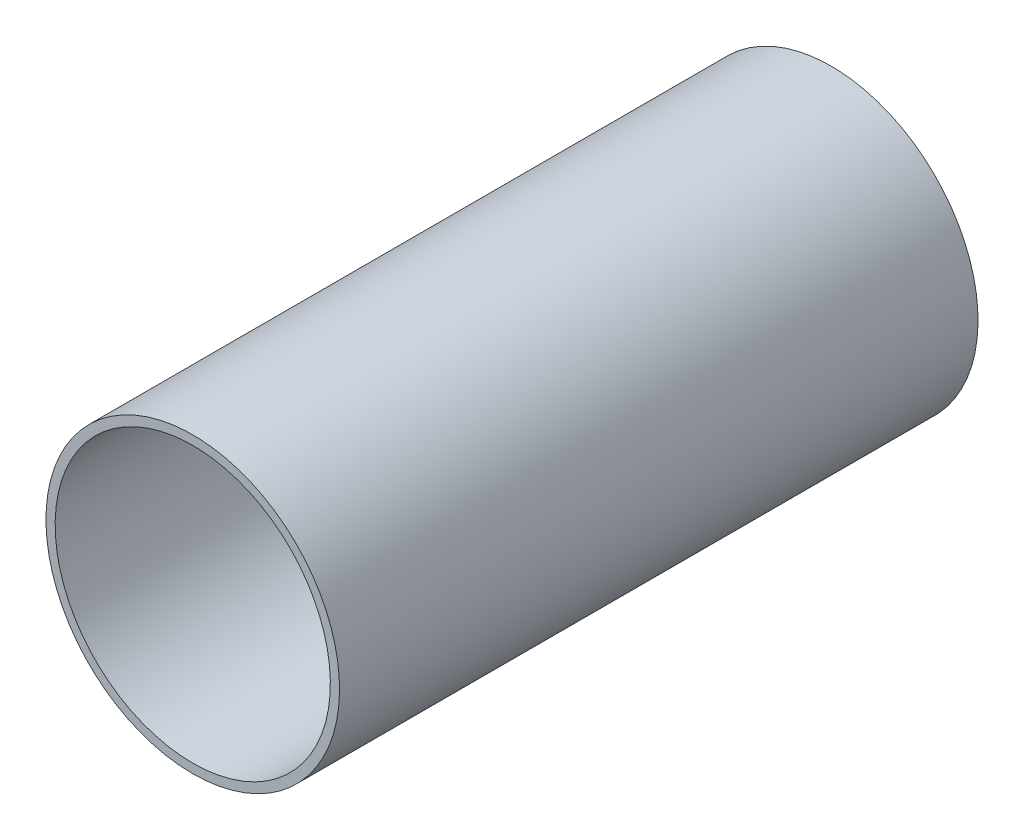
ISO-10303-21;
HEADER;
FILE_DESCRIPTION(('STEP AP214'),'2;1');
FILE_NAME('part.step','',(''),(''),'','','');
FILE_SCHEMA(('AUTOMOTIVE_DESIGN { 1 0 10303 214 1 1 1 1 }'));
ENDSEC;
DATA;
#1=APPLICATION_CONTEXT('core data for automotive mechanical design processes');
#2=APPLICATION_PROTOCOL_DEFINITION('international standard','automotive_design',2000,#1);
#3=PRODUCT_CONTEXT('',#1,'mechanical');
#4=PRODUCT('Part','Part','',(#3));
#5=PRODUCT_RELATED_PRODUCT_CATEGORY('part','',(#4));
#6=PRODUCT_DEFINITION_FORMATION('','',#4);
#7=PRODUCT_DEFINITION_CONTEXT('part definition',#1,'design');
#8=PRODUCT_DEFINITION('design','',#6,#7);
#9=PRODUCT_DEFINITION_SHAPE('','',#8);
#10=(LENGTH_UNIT() NAMED_UNIT(*) SI_UNIT(.MILLI.,.METRE.));
#11=(NAMED_UNIT(*) PLANE_ANGLE_UNIT() SI_UNIT($,.RADIAN.));
#12=(NAMED_UNIT(*) SI_UNIT($,.STERADIAN.) SOLID_ANGLE_UNIT());
#13=UNCERTAINTY_MEASURE_WITH_UNIT(LENGTH_MEASURE(1.E-05),#10,'distance_accuracy_value','');
#14=(GEOMETRIC_REPRESENTATION_CONTEXT(3) GLOBAL_UNCERTAINTY_ASSIGNED_CONTEXT((#13)) GLOBAL_UNIT_ASSIGNED_CONTEXT((#10,
#11,#12)) REPRESENTATION_CONTEXT('',''));
#15=CARTESIAN_POINT('',(0.,0.,0.));
#16=DIRECTION('',(0.,0.,1.));
#17=DIRECTION('',(1.,0.,0.));
#18=AXIS2_PLACEMENT_3D('',#15,#16,#17);
#19=CARTESIAN_POINT('',(165.1,-103.632,-0.045));
#20=DIRECTION('',(0.,0.,-1.));
#21=DIRECTION('',(0.,-1.,0.));
#22=AXIS2_PLACEMENT_3D('',#19,#20,#21);
#23=CYLINDRICAL_SURFACE('',#22,0.375);
#24=CARTESIAN_POINT('',(165.1,-103.632,-0.035));
#25=DIRECTION('',(0.,0.,-1.));
#26=DIRECTION('',(0.,-1.,0.));
#27=AXIS2_PLACEMENT_3D('',#24,#25,#26);
#28=CIRCLE('',#27,0.375);
#29=CARTESIAN_POINT('',(165.1,-104.007,-0.035));
#30=VERTEX_POINT('',#29);
#31=EDGE_CURVE('E65',#30,#30,#28,.T.);
#32=ORIENTED_EDGE('',*,*,#31,.T.);
#33=DIRECTION('',(0.,0.,1.));
#34=VECTOR('',#33,1.);
#35=CARTESIAN_POINT('',(165.1,-104.007,-0.045));
#36=LINE('',#35,#34);
#37=CARTESIAN_POINT('',(165.1,-104.007,1.705));
#38=VERTEX_POINT('',#37);
#39=EDGE_CURVE('E11',#30,#38,#36,.T.);
#40=ORIENTED_EDGE('',*,*,#39,.T.);
#41=CARTESIAN_POINT('',(165.1,-103.632,1.705));
#42=DIRECTION('',(0.,0.,-1.));
#43=DIRECTION('',(0.,-1.,0.));
#44=AXIS2_PLACEMENT_3D('',#41,#42,#43);
#45=CIRCLE('',#44,0.375);
#46=EDGE_CURVE('E20',#38,#38,#45,.T.);
#47=ORIENTED_EDGE('',*,*,#46,.F.);
#48=ORIENTED_EDGE('',*,*,#39,.F.);
#49=EDGE_LOOP('',(#32,#40,#47,#48));
#50=FACE_BOUND('',#49,.T.);
#51=ADVANCED_FACE('F17',(#50),#23,.F.);
#52=CARTESIAN_POINT('',(165.1,-104.032,1.705));
#53=DIRECTION('',(0.,0.,1.));
#54=DIRECTION('',(1.,0.,0.));
#55=AXIS2_PLACEMENT_3D('',#52,#53,#54);
#56=PLANE('',#55);
#57=ORIENTED_EDGE('',*,*,#46,.T.);
#58=EDGE_LOOP('',(#57));
#59=FACE_BOUND('',#58,.T.);
#60=CARTESIAN_POINT('',(165.1,-103.632,1.705));
#61=DIRECTION('',(0.,0.,1.));
#62=DIRECTION('',(0.,-1.,0.));
#63=AXIS2_PLACEMENT_3D('',#60,#61,#62);
#64=CIRCLE('',#63,0.4);
#65=CARTESIAN_POINT('',(165.1,-104.032,1.705));
#66=VERTEX_POINT('',#65);
#67=EDGE_CURVE('E57',#66,#66,#64,.T.);
#68=ORIENTED_EDGE('',*,*,#67,.T.);
#69=EDGE_LOOP('',(#68));
#70=FACE_BOUND('',#69,.T.);
#71=ADVANCED_FACE('F76',(#59,#70),#56,.T.);
#72=CARTESIAN_POINT('',(165.1,-104.032,-0.035));
#73=DIRECTION('',(0.,0.,1.));
#74=DIRECTION('',(1.,0.,0.));
#75=AXIS2_PLACEMENT_3D('',#72,#73,#74);
#76=PLANE('',#75);
#77=ORIENTED_EDGE('',*,*,#31,.F.);
#78=EDGE_LOOP('',(#77));
#79=FACE_BOUND('',#78,.T.);
#80=CARTESIAN_POINT('',(165.1,-103.632,-0.035));
#81=DIRECTION('',(0.,0.,1.));
#82=DIRECTION('',(0.,-1.,0.));
#83=AXIS2_PLACEMENT_3D('',#80,#81,#82);
#84=CIRCLE('',#83,0.4);
#85=CARTESIAN_POINT('',(165.1,-104.032,-0.035));
#86=VERTEX_POINT('',#85);
#87=EDGE_CURVE('E56',#86,#86,#84,.T.);
#88=ORIENTED_EDGE('',*,*,#87,.F.);
#89=EDGE_LOOP('',(#88));
#90=FACE_BOUND('',#89,.T.);
#91=ADVANCED_FACE('F84',(#79,#90),#76,.F.);
#92=CARTESIAN_POINT('',(165.1,-103.632,-0.035));
#93=DIRECTION('',(0.,0.,-1.));
#94=DIRECTION('',(0.,-1.,0.));
#95=AXIS2_PLACEMENT_3D('',#92,#93,#94);
#96=CYLINDRICAL_SURFACE('',#95,0.4);
#97=ORIENTED_EDGE('',*,*,#87,.T.);
#98=DIRECTION('',(0.,0.,1.));
#99=VECTOR('',#98,1.);
#100=CARTESIAN_POINT('',(165.1,-104.032,-0.035));
#101=LINE('',#100,#99);
#102=EDGE_CURVE('E53',#86,#66,#101,.T.);
#103=ORIENTED_EDGE('',*,*,#102,.T.);
#104=ORIENTED_EDGE('',*,*,#67,.F.);
#105=ORIENTED_EDGE('',*,*,#102,.F.);
#106=EDGE_LOOP('',(#97,#103,#104,#105));
#107=FACE_BOUND('',#106,.T.);
#108=ADVANCED_FACE('F54',(#107),#96,.T.);
#109=CLOSED_SHELL('',(#51,#71,#91,#108));
#110=MANIFOLD_SOLID_BREP('B1',#109);
#111=ADVANCED_BREP_SHAPE_REPRESENTATION('',(#18,#110),#14);
#112=SHAPE_DEFINITION_REPRESENTATION(#9,#111);
ENDSEC;
END-ISO-10303-21;
